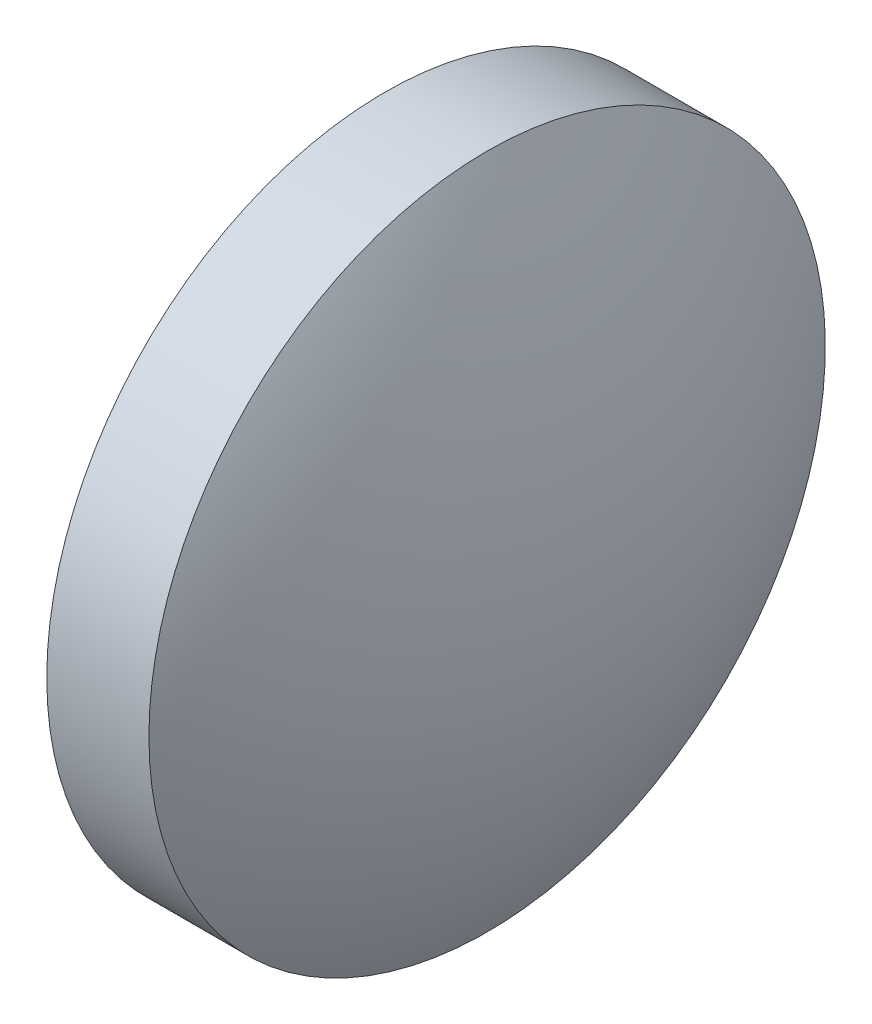
ISO-10303-21;
HEADER;
FILE_DESCRIPTION(('STEP AP214'),'2;1');
FILE_NAME('part.step','',(''),(''),'','','');
FILE_SCHEMA(('AUTOMOTIVE_DESIGN { 1 0 10303 214 1 1 1 1 }'));
ENDSEC;
DATA;
#1=APPLICATION_CONTEXT('core data for automotive mechanical design processes');
#2=APPLICATION_PROTOCOL_DEFINITION('international standard','automotive_design',2000,#1);
#3=PRODUCT_CONTEXT('',#1,'mechanical');
#4=PRODUCT('Part','Part','',(#3));
#5=PRODUCT_RELATED_PRODUCT_CATEGORY('part','',(#4));
#6=PRODUCT_DEFINITION_FORMATION('','',#4);
#7=PRODUCT_DEFINITION_CONTEXT('part definition',#1,'design');
#8=PRODUCT_DEFINITION('design','',#6,#7);
#9=PRODUCT_DEFINITION_SHAPE('','',#8);
#10=(LENGTH_UNIT() NAMED_UNIT(*) SI_UNIT(.MILLI.,.METRE.));
#11=(NAMED_UNIT(*) PLANE_ANGLE_UNIT() SI_UNIT($,.RADIAN.));
#12=(NAMED_UNIT(*) SI_UNIT($,.STERADIAN.) SOLID_ANGLE_UNIT());
#13=UNCERTAINTY_MEASURE_WITH_UNIT(LENGTH_MEASURE(1.E-05),#10,'distance_accuracy_value','');
#14=(GEOMETRIC_REPRESENTATION_CONTEXT(3) GLOBAL_UNCERTAINTY_ASSIGNED_CONTEXT((#13)) GLOBAL_UNIT_ASSIGNED_CONTEXT((#10,
#11,#12)) REPRESENTATION_CONTEXT('',''));
#15=CARTESIAN_POINT('',(0.,0.,0.));
#16=DIRECTION('',(0.,0.,1.));
#17=DIRECTION('',(1.,0.,0.));
#18=AXIS2_PLACEMENT_3D('',#15,#16,#17);
#19=CARTESIAN_POINT('',(643.067079984485,189.5627684869,0.));
#20=DIRECTION('',(-1.,0.,0.));
#21=DIRECTION('',(0.,1.,0.));
#22=AXIS2_PLACEMENT_3D('',#19,#20,#21);
#23=SPHERICAL_SURFACE('',#22,10.3349224806202);
#24=CARTESIAN_POINT('',(652.112002465105,189.5627684869,0.));
#25=DIRECTION('',(-1.,0.,0.));
#26=DIRECTION('',(0.,0.,1.));
#27=AXIS2_PLACEMENT_3D('',#24,#25,#26);
#28=CIRCLE('',#27,5.);
#29=CARTESIAN_POINT('',(652.112002465105,189.5627684869,5.));
#30=VERTEX_POINT('',#29);
#31=EDGE_CURVE('E10',#30,#30,#28,.T.);
#32=ORIENTED_EDGE('',*,*,#31,.F.);
#33=EDGE_LOOP('',(#32));
#34=FACE_BOUND('',#33,.T.);
#35=ADVANCED_FACE('F35',(#34),#23,.T.);
#36=CARTESIAN_POINT('',(649.660451993331,189.5627684869,0.));
#37=DIRECTION('',(-1.,0.,0.));
#38=DIRECTION('',(0.,0.,1.));
#39=AXIS2_PLACEMENT_3D('',#36,#37,#38);
#40=CYLINDRICAL_SURFACE('',#39,5.);
#41=CARTESIAN_POINT('',(650.602002465105,189.5627684869,0.));
#42=DIRECTION('',(-1.,0.,0.));
#43=DIRECTION('',(0.,0.,1.));
#44=AXIS2_PLACEMENT_3D('',#41,#42,#43);
#45=CIRCLE('',#44,5.);
#46=CARTESIAN_POINT('',(650.602002465105,189.5627684869,5.));
#47=VERTEX_POINT('',#46);
#48=EDGE_CURVE('E41',#47,#47,#45,.T.);
#49=ORIENTED_EDGE('',*,*,#48,.F.);
#50=EDGE_LOOP('',(#49));
#51=FACE_BOUND('',#50,.T.);
#52=ORIENTED_EDGE('',*,*,#31,.T.);
#53=EDGE_LOOP('',(#52));
#54=FACE_BOUND('',#53,.T.);
#55=ADVANCED_FACE('F49',(#51,#54),#40,.T.);
#56=CARTESIAN_POINT('',(650.602002465105,189.5627684869,0.));
#57=DIRECTION('',(1.,0.,0.));
#58=DIRECTION('',(0.,0.,-1.));
#59=AXIS2_PLACEMENT_3D('',#56,#57,#58);
#60=PLANE('',#59);
#61=ORIENTED_EDGE('',*,*,#48,.T.);
#62=EDGE_LOOP('',(#61));
#63=FACE_BOUND('',#62,.T.);
#64=ADVANCED_FACE('F47',(#63),#60,.F.);
#65=CLOSED_SHELL('',(#35,#55,#64));
#66=MANIFOLD_SOLID_BREP('B2',#65);
#67=ADVANCED_BREP_SHAPE_REPRESENTATION('',(#18,#66),#14);
#68=SHAPE_DEFINITION_REPRESENTATION(#9,#67);
ENDSEC;
END-ISO-10303-21;
